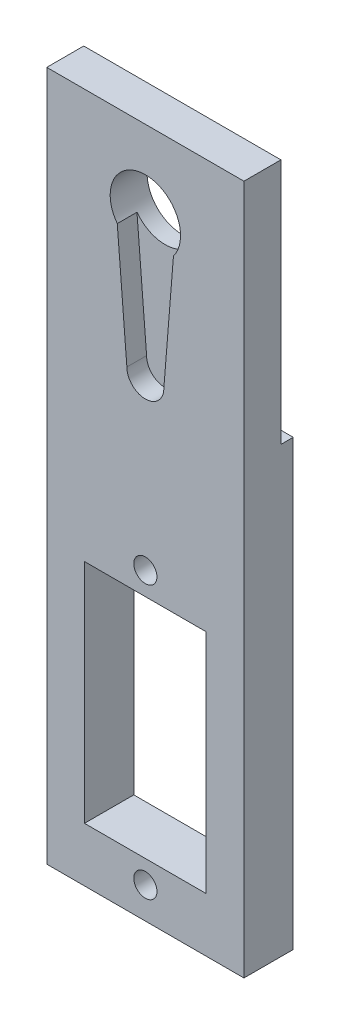
ISO-10303-21;
HEADER;
FILE_DESCRIPTION(('STEP AP214'),'2;1');
FILE_NAME('part.step','',(''),(''),'','','');
FILE_SCHEMA(('AUTOMOTIVE_DESIGN { 1 0 10303 214 1 1 1 1 }'));
ENDSEC;
DATA;
#1=APPLICATION_CONTEXT('core data for automotive mechanical design processes');
#2=APPLICATION_PROTOCOL_DEFINITION('international standard','automotive_design',2000,#1);
#3=PRODUCT_CONTEXT('',#1,'mechanical');
#4=PRODUCT('Part','Part','',(#3));
#5=PRODUCT_RELATED_PRODUCT_CATEGORY('part','',(#4));
#6=PRODUCT_DEFINITION_FORMATION('','',#4);
#7=PRODUCT_DEFINITION_CONTEXT('part definition',#1,'design');
#8=PRODUCT_DEFINITION('design','',#6,#7);
#9=PRODUCT_DEFINITION_SHAPE('','',#8);
#10=(LENGTH_UNIT() NAMED_UNIT(*) SI_UNIT(.MILLI.,.METRE.));
#11=(NAMED_UNIT(*) PLANE_ANGLE_UNIT() SI_UNIT($,.RADIAN.));
#12=(NAMED_UNIT(*) SI_UNIT($,.STERADIAN.) SOLID_ANGLE_UNIT());
#13=UNCERTAINTY_MEASURE_WITH_UNIT(LENGTH_MEASURE(1.E-05),#10,'distance_accuracy_value','');
#14=(GEOMETRIC_REPRESENTATION_CONTEXT(3) GLOBAL_UNCERTAINTY_ASSIGNED_CONTEXT((#13)) GLOBAL_UNIT_ASSIGNED_CONTEXT((#10,
#11,#12)) REPRESENTATION_CONTEXT('',''));
#15=CARTESIAN_POINT('',(0.,0.,0.));
#16=DIRECTION('',(0.,0.,1.));
#17=DIRECTION('',(1.,0.,0.));
#18=AXIS2_PLACEMENT_3D('',#15,#16,#17);
#19=CARTESIAN_POINT('',(9.99999999999999,35.,5.));
#20=DIRECTION('',(-1.,0.,0.));
#21=DIRECTION('',(0.,-1.,0.));
#22=AXIS2_PLACEMENT_3D('',#19,#20,#21);
#23=PLANE('',#22);
#24=DIRECTION('',(0.,1.,0.));
#25=VECTOR('',#24,1.);
#26=CARTESIAN_POINT('',(9.99999999999999,35.,0.));
#27=LINE('',#26,#25);
#28=CARTESIAN_POINT('',(10.,-35.,0.));
#29=VERTEX_POINT('',#28);
#30=CARTESIAN_POINT('',(10.,10.,0.));
#31=VERTEX_POINT('',#30);
#32=EDGE_CURVE('E189',#29,#31,#27,.T.);
#33=ORIENTED_EDGE('',*,*,#32,.T.);
#34=DIRECTION('',(0.,0.,-1.));
#35=VECTOR('',#34,1.);
#36=CARTESIAN_POINT('',(10.,10.,0.));
#37=LINE('',#36,#35);
#38=CARTESIAN_POINT('',(10.,10.,1.25));
#39=VERTEX_POINT('',#38);
#40=EDGE_CURVE('E62',#39,#31,#37,.T.);
#41=ORIENTED_EDGE('',*,*,#40,.F.);
#42=DIRECTION('',(0.,-1.,0.));
#43=VECTOR('',#42,1.);
#44=CARTESIAN_POINT('',(9.99999999999999,35.,1.25));
#45=LINE('',#44,#43);
#46=CARTESIAN_POINT('',(9.99999999999999,35.,1.25));
#47=VERTEX_POINT('',#46);
#48=EDGE_CURVE('E152',#47,#39,#45,.T.);
#49=ORIENTED_EDGE('',*,*,#48,.F.);
#50=DIRECTION('',(0.,0.,-1.));
#51=VECTOR('',#50,1.);
#52=CARTESIAN_POINT('',(9.99999999999999,35.,5.));
#53=LINE('',#52,#51);
#54=CARTESIAN_POINT('',(9.99999999999999,35.,5.));
#55=VERTEX_POINT('',#54);
#56=EDGE_CURVE('E12',#55,#47,#53,.T.);
#57=ORIENTED_EDGE('',*,*,#56,.F.);
#58=DIRECTION('',(0.,1.,0.));
#59=VECTOR('',#58,1.);
#60=CARTESIAN_POINT('',(9.99999999999999,35.,5.));
#61=LINE('',#60,#59);
#62=CARTESIAN_POINT('',(10.,-35.,5.));
#63=VERTEX_POINT('',#62);
#64=EDGE_CURVE('E171',#63,#55,#61,.T.);
#65=ORIENTED_EDGE('',*,*,#64,.F.);
#66=DIRECTION('',(0.,0.,-1.));
#67=VECTOR('',#66,1.);
#68=CARTESIAN_POINT('',(10.,-35.,5.));
#69=LINE('',#68,#67);
#70=EDGE_CURVE('E188',#63,#29,#69,.T.);
#71=ORIENTED_EDGE('',*,*,#70,.T.);
#72=EDGE_LOOP('',(#33,#41,#49,#57,#65,#71));
#73=FACE_BOUND('',#72,.T.);
#74=ADVANCED_FACE('F47',(#73),#23,.F.);
#75=CARTESIAN_POINT('',(-10.,35.,5.));
#76=DIRECTION('',(0.,-1.,0.));
#77=DIRECTION('',(0.,0.,-1.));
#78=AXIS2_PLACEMENT_3D('',#75,#76,#77);
#79=PLANE('',#78);
#80=ORIENTED_EDGE('',*,*,#56,.T.);
#81=DIRECTION('',(1.,0.,0.));
#82=VECTOR('',#81,1.);
#83=CARTESIAN_POINT('',(-20.,35.,1.25));
#84=LINE('',#83,#82);
#85=CARTESIAN_POINT('',(-10.,35.,1.25));
#86=VERTEX_POINT('',#85);
#87=EDGE_CURVE('E148',#86,#47,#84,.T.);
#88=ORIENTED_EDGE('',*,*,#87,.F.);
#89=DIRECTION('',(0.,0.,-1.));
#90=VECTOR('',#89,1.);
#91=CARTESIAN_POINT('',(-10.,35.,5.));
#92=LINE('',#91,#90);
#93=CARTESIAN_POINT('',(-10.,35.,5.));
#94=VERTEX_POINT('',#93);
#95=EDGE_CURVE('E55',#94,#86,#92,.T.);
#96=ORIENTED_EDGE('',*,*,#95,.F.);
#97=DIRECTION('',(-1.,0.,0.));
#98=VECTOR('',#97,1.);
#99=CARTESIAN_POINT('',(-10.,35.,5.));
#100=LINE('',#99,#98);
#101=EDGE_CURVE('E166',#55,#94,#100,.T.);
#102=ORIENTED_EDGE('',*,*,#101,.F.);
#103=EDGE_LOOP('',(#80,#88,#96,#102));
#104=FACE_BOUND('',#103,.T.);
#105=ADVANCED_FACE('F165',(#104),#79,.F.);
#106=CARTESIAN_POINT('',(-10.,35.,5.));
#107=DIRECTION('',(1.,0.,0.));
#108=DIRECTION('',(0.,1.,0.));
#109=AXIS2_PLACEMENT_3D('',#106,#107,#108);
#110=PLANE('',#109);
#111=DIRECTION('',(0.,-1.,0.));
#112=VECTOR('',#111,1.);
#113=CARTESIAN_POINT('',(-10.,35.,1.25));
#114=LINE('',#113,#112);
#115=CARTESIAN_POINT('',(-10.,10.,1.25));
#116=VERTEX_POINT('',#115);
#117=EDGE_CURVE('E154',#86,#116,#114,.T.);
#118=ORIENTED_EDGE('',*,*,#117,.T.);
#119=DIRECTION('',(0.,0.,-1.));
#120=VECTOR('',#119,1.);
#121=CARTESIAN_POINT('',(-10.,10.,5.));
#122=LINE('',#121,#120);
#123=CARTESIAN_POINT('',(-10.,10.,0.));
#124=VERTEX_POINT('',#123);
#125=EDGE_CURVE('E215',#116,#124,#122,.T.);
#126=ORIENTED_EDGE('',*,*,#125,.T.);
#127=DIRECTION('',(0.,-1.,0.));
#128=VECTOR('',#127,1.);
#129=CARTESIAN_POINT('',(-10.,35.,0.));
#130=LINE('',#129,#128);
#131=CARTESIAN_POINT('',(-10.,-35.,0.));
#132=VERTEX_POINT('',#131);
#133=EDGE_CURVE('E180',#124,#132,#130,.T.);
#134=ORIENTED_EDGE('',*,*,#133,.T.);
#135=DIRECTION('',(0.,0.,-1.));
#136=VECTOR('',#135,1.);
#137=CARTESIAN_POINT('',(-10.,-35.,5.));
#138=LINE('',#137,#136);
#139=CARTESIAN_POINT('',(-10.,-35.,5.));
#140=VERTEX_POINT('',#139);
#141=EDGE_CURVE('E194',#140,#132,#138,.T.);
#142=ORIENTED_EDGE('',*,*,#141,.F.);
#143=DIRECTION('',(0.,-1.,0.));
#144=VECTOR('',#143,1.);
#145=CARTESIAN_POINT('',(-10.,35.,5.));
#146=LINE('',#145,#144);
#147=EDGE_CURVE('E170',#94,#140,#146,.T.);
#148=ORIENTED_EDGE('',*,*,#147,.F.);
#149=ORIENTED_EDGE('',*,*,#95,.T.);
#150=EDGE_LOOP('',(#118,#126,#134,#142,#148,#149));
#151=FACE_BOUND('',#150,.T.);
#152=ADVANCED_FACE('F198',(#151),#110,.F.);
#153=CARTESIAN_POINT('',(-10.,-35.,5.));
#154=DIRECTION('',(0.,1.,0.));
#155=DIRECTION('',(0.,0.,1.));
#156=AXIS2_PLACEMENT_3D('',#153,#154,#155);
#157=PLANE('',#156);
#158=DIRECTION('',(1.,0.,0.));
#159=VECTOR('',#158,1.);
#160=CARTESIAN_POINT('',(-10.,-35.,0.));
#161=LINE('',#160,#159);
#162=EDGE_CURVE('E178',#132,#29,#161,.T.);
#163=ORIENTED_EDGE('',*,*,#162,.T.);
#164=ORIENTED_EDGE('',*,*,#70,.F.);
#165=DIRECTION('',(1.,0.,0.));
#166=VECTOR('',#165,1.);
#167=CARTESIAN_POINT('',(-10.,-35.,5.));
#168=LINE('',#167,#166);
#169=EDGE_CURVE('E175',#140,#63,#168,.T.);
#170=ORIENTED_EDGE('',*,*,#169,.F.);
#171=ORIENTED_EDGE('',*,*,#141,.T.);
#172=EDGE_LOOP('',(#163,#164,#170,#171));
#173=FACE_BOUND('',#172,.T.);
#174=ADVANCED_FACE('F204',(#173),#157,.F.);
#175=CARTESIAN_POINT('',(0.,0.,5.));
#176=DIRECTION('',(0.,0.,1.));
#177=DIRECTION('',(1.,0.,0.));
#178=AXIS2_PLACEMENT_3D('',#175,#176,#177);
#179=PLANE('',#178);
#180=CARTESIAN_POINT('',(0.,-31.82,5.));
#181=DIRECTION('',(0.,0.,1.));
#182=DIRECTION('',(-1.,0.,0.));
#183=AXIS2_PLACEMENT_3D('',#180,#181,#182);
#184=CIRCLE('',#183,1.175);
#185=CARTESIAN_POINT('',(-1.175,-31.82,5.));
#186=VERTEX_POINT('',#185);
#187=EDGE_CURVE('E217',#186,#186,#184,.T.);
#188=ORIENTED_EDGE('',*,*,#187,.F.);
#189=EDGE_LOOP('',(#188));
#190=FACE_BOUND('',#189,.T.);
#191=CARTESIAN_POINT('',(0.,-4.17999999999999,5.));
#192=DIRECTION('',(0.,0.,1.));
#193=DIRECTION('',(1.,0.,0.));
#194=AXIS2_PLACEMENT_3D('',#191,#192,#193);
#195=CIRCLE('',#194,1.175);
#196=CARTESIAN_POINT('',(1.175,-4.17999999999999,5.));
#197=VERTEX_POINT('',#196);
#198=EDGE_CURVE('E221',#197,#197,#195,.T.);
#199=ORIENTED_EDGE('',*,*,#198,.F.);
#200=EDGE_LOOP('',(#199));
#201=FACE_BOUND('',#200,.T.);
#202=DIRECTION('',(0.,1.,0.));
#203=VECTOR('',#202,1.);
#204=CARTESIAN_POINT('',(6.175,-6.49999999999998,5.));
#205=LINE('',#204,#203);
#206=CARTESIAN_POINT('',(6.175,-29.5,5.));
#207=VERTEX_POINT('',#206);
#208=CARTESIAN_POINT('',(6.175,-6.49999999999998,5.));
#209=VERTEX_POINT('',#208);
#210=EDGE_CURVE('E70',#207,#209,#205,.T.);
#211=ORIENTED_EDGE('',*,*,#210,.F.);
#212=DIRECTION('',(1.,0.,0.));
#213=VECTOR('',#212,1.);
#214=CARTESIAN_POINT('',(-6.175,-29.5,5.));
#215=LINE('',#214,#213);
#216=CARTESIAN_POINT('',(-6.175,-29.5,5.));
#217=VERTEX_POINT('',#216);
#218=EDGE_CURVE('E233',#217,#207,#215,.T.);
#219=ORIENTED_EDGE('',*,*,#218,.F.);
#220=DIRECTION('',(0.,-1.,0.));
#221=VECTOR('',#220,1.);
#222=CARTESIAN_POINT('',(-6.175,-6.49999999999998,5.));
#223=LINE('',#222,#221);
#224=CARTESIAN_POINT('',(-6.175,-6.49999999999998,5.));
#225=VERTEX_POINT('',#224);
#226=EDGE_CURVE('E247',#225,#217,#223,.T.);
#227=ORIENTED_EDGE('',*,*,#226,.F.);
#228=DIRECTION('',(-1.,0.,0.));
#229=VECTOR('',#228,1.);
#230=CARTESIAN_POINT('',(-6.175,-6.49999999999998,5.));
#231=LINE('',#230,#229);
#232=EDGE_CURVE('E244',#209,#225,#231,.T.);
#233=ORIENTED_EDGE('',*,*,#232,.F.);
#234=EDGE_LOOP('',(#211,#219,#227,#233));
#235=FACE_BOUND('',#234,.T.);
#236=CARTESIAN_POINT('',(0.,12.7392068094734,5.));
#237=DIRECTION('',(0.,0.,1.));
#238=DIRECTION('',(1.,0.,0.));
#239=AXIS2_PLACEMENT_3D('',#236,#237,#238);
#240=CIRCLE('',#239,1.875);
#241=CARTESIAN_POINT('',(-1.875,12.7392068094734,5.));
#242=VERTEX_POINT('',#241);
#243=CARTESIAN_POINT('',(1.875,12.7392068094734,5.));
#244=VERTEX_POINT('',#243);
#245=EDGE_CURVE('E271',#242,#244,#240,.T.);
#246=ORIENTED_EDGE('',*,*,#245,.F.);
#247=DIRECTION('',(0.0802469135802469,-0.996775016170071,0.));
#248=VECTOR('',#247,1.);
#249=CARTESIAN_POINT('',(-0.843940626703052,-0.0679427447912119,5.));
#250=LINE('',#249,#248);
#251=CARTESIAN_POINT('',(-2.85,24.8500232559397,5.));
#252=VERTEX_POINT('',#251);
#253=EDGE_CURVE('E265',#252,#242,#250,.T.);
#254=ORIENTED_EDGE('',*,*,#253,.F.);
#255=CARTESIAN_POINT('',(0.,27.,5.));
#256=DIRECTION('',(0.,0.,1.));
#257=DIRECTION('',(1.,0.,0.));
#258=AXIS2_PLACEMENT_3D('',#255,#256,#257);
#259=CIRCLE('',#258,3.57);
#260=CARTESIAN_POINT('',(2.85,24.8500232559397,5.));
#261=VERTEX_POINT('',#260);
#262=EDGE_CURVE('E183',#261,#252,#259,.T.);
#263=ORIENTED_EDGE('',*,*,#262,.F.);
#264=DIRECTION('',(-0.0802469135802469,-0.996775016170071,0.));
#265=VECTOR('',#264,1.);
#266=CARTESIAN_POINT('',(0.843940626703052,-0.0679427447912119,5.));
#267=LINE('',#266,#265);
#268=EDGE_CURVE('E274',#261,#244,#267,.T.);
#269=ORIENTED_EDGE('',*,*,#268,.T.);
#270=EDGE_LOOP('',(#246,#254,#263,#269));
#271=FACE_BOUND('',#270,.T.);
#272=ORIENTED_EDGE('',*,*,#64,.T.);
#273=ORIENTED_EDGE('',*,*,#101,.T.);
#274=ORIENTED_EDGE('',*,*,#147,.T.);
#275=ORIENTED_EDGE('',*,*,#169,.T.);
#276=EDGE_LOOP('',(#272,#273,#274,#275));
#277=FACE_BOUND('',#276,.T.);
#278=ADVANCED_FACE('F173',(#190,#201,#235,#271,#277),#179,.T.);
#279=CARTESIAN_POINT('',(0.,0.,0.));
#280=DIRECTION('',(0.,0.,1.));
#281=DIRECTION('',(1.,0.,0.));
#282=AXIS2_PLACEMENT_3D('',#279,#280,#281);
#283=PLANE('',#282);
#284=CARTESIAN_POINT('',(0.,-31.82,0.));
#285=DIRECTION('',(0.,0.,1.));
#286=DIRECTION('',(-1.,0.,0.));
#287=AXIS2_PLACEMENT_3D('',#284,#285,#286);
#288=CIRCLE('',#287,1.175);
#289=CARTESIAN_POINT('',(-1.175,-31.82,0.));
#290=VERTEX_POINT('',#289);
#291=EDGE_CURVE('E224',#290,#290,#288,.T.);
#292=ORIENTED_EDGE('',*,*,#291,.T.);
#293=EDGE_LOOP('',(#292));
#294=FACE_BOUND('',#293,.T.);
#295=CARTESIAN_POINT('',(0.,-4.17999999999999,0.));
#296=DIRECTION('',(0.,0.,1.));
#297=DIRECTION('',(1.,0.,0.));
#298=AXIS2_PLACEMENT_3D('',#295,#296,#297);
#299=CIRCLE('',#298,1.175);
#300=CARTESIAN_POINT('',(1.175,-4.17999999999999,0.));
#301=VERTEX_POINT('',#300);
#302=EDGE_CURVE('E218',#301,#301,#299,.T.);
#303=ORIENTED_EDGE('',*,*,#302,.T.);
#304=EDGE_LOOP('',(#303));
#305=FACE_BOUND('',#304,.T.);
#306=DIRECTION('',(1.,0.,0.));
#307=VECTOR('',#306,1.);
#308=CARTESIAN_POINT('',(-6.175,-29.5,0.));
#309=LINE('',#308,#307);
#310=CARTESIAN_POINT('',(-6.175,-29.5,0.));
#311=VERTEX_POINT('',#310);
#312=CARTESIAN_POINT('',(6.175,-29.5,0.));
#313=VERTEX_POINT('',#312);
#314=EDGE_CURVE('E239',#311,#313,#309,.T.);
#315=ORIENTED_EDGE('',*,*,#314,.T.);
#316=DIRECTION('',(0.,1.,0.));
#317=VECTOR('',#316,1.);
#318=CARTESIAN_POINT('',(6.175,-6.49999999999998,0.));
#319=LINE('',#318,#317);
#320=CARTESIAN_POINT('',(6.175,-6.49999999999998,0.));
#321=VERTEX_POINT('',#320);
#322=EDGE_CURVE('E229',#313,#321,#319,.T.);
#323=ORIENTED_EDGE('',*,*,#322,.T.);
#324=DIRECTION('',(-1.,0.,0.));
#325=VECTOR('',#324,1.);
#326=CARTESIAN_POINT('',(-6.175,-6.49999999999998,0.));
#327=LINE('',#326,#325);
#328=CARTESIAN_POINT('',(-6.175,-6.49999999999998,0.));
#329=VERTEX_POINT('',#328);
#330=EDGE_CURVE('E232',#321,#329,#327,.T.);
#331=ORIENTED_EDGE('',*,*,#330,.T.);
#332=DIRECTION('',(0.,-1.,0.));
#333=VECTOR('',#332,1.);
#334=CARTESIAN_POINT('',(-6.175,-6.49999999999998,0.));
#335=LINE('',#334,#333);
#336=EDGE_CURVE('E236',#329,#311,#335,.T.);
#337=ORIENTED_EDGE('',*,*,#336,.T.);
#338=EDGE_LOOP('',(#315,#323,#331,#337));
#339=FACE_BOUND('',#338,.T.);
#340=ORIENTED_EDGE('',*,*,#133,.F.);
#341=DIRECTION('',(1.,0.,0.));
#342=VECTOR('',#341,1.);
#343=CARTESIAN_POINT('',(-20.,10.,0.));
#344=LINE('',#343,#342);
#345=EDGE_CURVE('E208',#124,#31,#344,.T.);
#346=ORIENTED_EDGE('',*,*,#345,.T.);
#347=ORIENTED_EDGE('',*,*,#32,.F.);
#348=ORIENTED_EDGE('',*,*,#162,.F.);
#349=EDGE_LOOP('',(#340,#346,#347,#348));
#350=FACE_BOUND('',#349,.T.);
#351=ADVANCED_FACE('F207',(#294,#305,#339,#350),#283,.F.);
#352=CARTESIAN_POINT('',(0.,12.7392068094734,3.));
#353=DIRECTION('',(0.,0.,1.));
#354=DIRECTION('',(1.,0.,0.));
#355=AXIS2_PLACEMENT_3D('',#352,#353,#354);
#356=CYLINDRICAL_SURFACE('',#355,1.875);
#357=ORIENTED_EDGE('',*,*,#245,.T.);
#358=DIRECTION('',(0.,0.,1.));
#359=VECTOR('',#358,1.);
#360=CARTESIAN_POINT('',(1.875,12.7392068094734,3.));
#361=LINE('',#360,#359);
#362=CARTESIAN_POINT('',(1.875,12.7392068094734,3.));
#363=VERTEX_POINT('',#362);
#364=EDGE_CURVE('E270',#363,#244,#361,.T.);
#365=ORIENTED_EDGE('',*,*,#364,.F.);
#366=CARTESIAN_POINT('',(0.,12.7392068094734,3.));
#367=DIRECTION('',(0.,0.,1.));
#368=DIRECTION('',(1.,0.,0.));
#369=AXIS2_PLACEMENT_3D('',#366,#367,#368);
#370=CIRCLE('',#369,1.875);
#371=CARTESIAN_POINT('',(-1.875,12.7392068094734,3.));
#372=VERTEX_POINT('',#371);
#373=EDGE_CURVE('E261',#372,#363,#370,.T.);
#374=ORIENTED_EDGE('',*,*,#373,.F.);
#375=DIRECTION('',(0.,0.,1.));
#376=VECTOR('',#375,1.);
#377=CARTESIAN_POINT('',(-1.875,12.7392068094734,3.));
#378=LINE('',#377,#376);
#379=EDGE_CURVE('E191',#372,#242,#378,.T.);
#380=ORIENTED_EDGE('',*,*,#379,.T.);
#381=EDGE_LOOP('',(#357,#365,#374,#380));
#382=FACE_BOUND('',#381,.T.);
#383=ADVANCED_FACE('F292',(#382),#356,.F.);
#384=CARTESIAN_POINT('',(-0.843940626703052,-0.0679427447912119,3.));
#385=DIRECTION('',(-0.996775016170071,-0.0802469135802469,0.));
#386=DIRECTION('',(0.0802469135802469,-0.996775016170071,0.));
#387=AXIS2_PLACEMENT_3D('',#384,#385,#386);
#388=PLANE('',#387);
#389=ORIENTED_EDGE('',*,*,#253,.T.);
#390=ORIENTED_EDGE('',*,*,#379,.F.);
#391=DIRECTION('',(0.0802469135802469,-0.996775016170071,0.));
#392=VECTOR('',#391,1.);
#393=CARTESIAN_POINT('',(-0.843940626703052,-0.0679427447912119,3.));
#394=LINE('',#393,#392);
#395=CARTESIAN_POINT('',(-2.85,24.8500232559397,3.));
#396=VERTEX_POINT('',#395);
#397=EDGE_CURVE('E267',#396,#372,#394,.T.);
#398=ORIENTED_EDGE('',*,*,#397,.F.);
#399=DIRECTION('',(0.,0.,1.));
#400=VECTOR('',#399,1.);
#401=CARTESIAN_POINT('',(-2.85,24.8500232559397,3.));
#402=LINE('',#401,#400);
#403=EDGE_CURVE('E280',#396,#252,#402,.T.);
#404=ORIENTED_EDGE('',*,*,#403,.T.);
#405=EDGE_LOOP('',(#389,#390,#398,#404));
#406=FACE_BOUND('',#405,.T.);
#407=ADVANCED_FACE('F304',(#406),#388,.F.);
#408=CARTESIAN_POINT('',(0.843940626703052,-0.0679427447912119,3.));
#409=DIRECTION('',(-0.996775016170071,0.0802469135802469,0.));
#410=DIRECTION('',(-0.0802469135802469,-0.996775016170071,0.));
#411=AXIS2_PLACEMENT_3D('',#408,#409,#410);
#412=PLANE('',#411);
#413=ORIENTED_EDGE('',*,*,#268,.F.);
#414=DIRECTION('',(0.,0.,1.));
#415=VECTOR('',#414,1.);
#416=CARTESIAN_POINT('',(2.85,24.8500232559397,3.));
#417=LINE('',#416,#415);
#418=CARTESIAN_POINT('',(2.85,24.8500232559397,3.));
#419=VERTEX_POINT('',#418);
#420=EDGE_CURVE('E282',#419,#261,#417,.T.);
#421=ORIENTED_EDGE('',*,*,#420,.F.);
#422=DIRECTION('',(-0.0802469135802469,-0.996775016170071,0.));
#423=VECTOR('',#422,1.);
#424=CARTESIAN_POINT('',(0.843940626703052,-0.0679427447912119,3.));
#425=LINE('',#424,#423);
#426=EDGE_CURVE('E264',#419,#363,#425,.T.);
#427=ORIENTED_EDGE('',*,*,#426,.T.);
#428=ORIENTED_EDGE('',*,*,#364,.T.);
#429=EDGE_LOOP('',(#413,#421,#427,#428));
#430=FACE_BOUND('',#429,.T.);
#431=ADVANCED_FACE('F286',(#430),#412,.T.);
#432=CARTESIAN_POINT('',(0.,0.,3.));
#433=DIRECTION('',(0.,0.,1.));
#434=DIRECTION('',(1.,0.,0.));
#435=AXIS2_PLACEMENT_3D('',#432,#433,#434);
#436=PLANE('',#435);
#437=CARTESIAN_POINT('',(0.,27.,3.));
#438=DIRECTION('',(0.,0.,1.));
#439=DIRECTION('',(1.,0.,0.));
#440=AXIS2_PLACEMENT_3D('',#437,#438,#439);
#441=CIRCLE('',#440,3.57);
#442=EDGE_CURVE('E254',#396,#419,#441,.T.);
#443=ORIENTED_EDGE('',*,*,#442,.F.);
#444=ORIENTED_EDGE('',*,*,#397,.T.);
#445=ORIENTED_EDGE('',*,*,#373,.T.);
#446=ORIENTED_EDGE('',*,*,#426,.F.);
#447=EDGE_LOOP('',(#443,#444,#445,#446));
#448=FACE_BOUND('',#447,.T.);
#449=ADVANCED_FACE('F302',(#448),#436,.T.);
#450=CARTESIAN_POINT('',(0.,27.,3.));
#451=DIRECTION('',(0.,0.,1.));
#452=DIRECTION('',(1.,0.,0.));
#453=AXIS2_PLACEMENT_3D('',#450,#451,#452);
#454=CYLINDRICAL_SURFACE('',#453,3.57);
#455=CARTESIAN_POINT('',(0.,27.,1.25));
#456=DIRECTION('',(0.,0.,1.));
#457=DIRECTION('',(0.,-1.,0.));
#458=AXIS2_PLACEMENT_3D('',#455,#456,#457);
#459=CIRCLE('',#458,3.57);
#460=CARTESIAN_POINT('',(0.,23.43,1.25));
#461=VERTEX_POINT('',#460);
#462=EDGE_CURVE('E50',#461,#461,#459,.F.);
#463=ORIENTED_EDGE('',*,*,#462,.T.);
#464=EDGE_LOOP('',(#463));
#465=FACE_BOUND('',#464,.T.);
#466=ORIENTED_EDGE('',*,*,#403,.F.);
#467=ORIENTED_EDGE('',*,*,#442,.T.);
#468=ORIENTED_EDGE('',*,*,#420,.T.);
#469=ORIENTED_EDGE('',*,*,#262,.T.);
#470=EDGE_LOOP('',(#466,#467,#468,#469));
#471=FACE_BOUND('',#470,.T.);
#472=ADVANCED_FACE('F299',(#465,#471),#454,.F.);
#473=CARTESIAN_POINT('',(6.175,-6.49999999999998,0.));
#474=DIRECTION('',(1.,0.,0.));
#475=DIRECTION('',(0.,1.,0.));
#476=AXIS2_PLACEMENT_3D('',#473,#474,#475);
#477=PLANE('',#476);
#478=ORIENTED_EDGE('',*,*,#210,.T.);
#479=DIRECTION('',(0.,0.,1.));
#480=VECTOR('',#479,1.);
#481=CARTESIAN_POINT('',(6.175,-6.49999999999998,0.));
#482=LINE('',#481,#480);
#483=EDGE_CURVE('E242',#321,#209,#482,.T.);
#484=ORIENTED_EDGE('',*,*,#483,.F.);
#485=ORIENTED_EDGE('',*,*,#322,.F.);
#486=DIRECTION('',(0.,0.,1.));
#487=VECTOR('',#486,1.);
#488=CARTESIAN_POINT('',(6.175,-29.5,0.));
#489=LINE('',#488,#487);
#490=EDGE_CURVE('E252',#313,#207,#489,.T.);
#491=ORIENTED_EDGE('',*,*,#490,.T.);
#492=EDGE_LOOP('',(#478,#484,#485,#491));
#493=FACE_BOUND('',#492,.T.);
#494=ADVANCED_FACE('F332',(#493),#477,.F.);
#495=CARTESIAN_POINT('',(-6.175,-29.5,0.));
#496=DIRECTION('',(0.,-1.,0.));
#497=DIRECTION('',(0.,0.,-1.));
#498=AXIS2_PLACEMENT_3D('',#495,#496,#497);
#499=PLANE('',#498);
#500=ORIENTED_EDGE('',*,*,#218,.T.);
#501=ORIENTED_EDGE('',*,*,#490,.F.);
#502=ORIENTED_EDGE('',*,*,#314,.F.);
#503=DIRECTION('',(0.,0.,1.));
#504=VECTOR('',#503,1.);
#505=CARTESIAN_POINT('',(-6.175,-29.5,0.));
#506=LINE('',#505,#504);
#507=EDGE_CURVE('E255',#311,#217,#506,.T.);
#508=ORIENTED_EDGE('',*,*,#507,.T.);
#509=EDGE_LOOP('',(#500,#501,#502,#508));
#510=FACE_BOUND('',#509,.T.);
#511=ADVANCED_FACE('F338',(#510),#499,.F.);
#512=CARTESIAN_POINT('',(-6.175,-6.49999999999998,0.));
#513=DIRECTION('',(-1.,0.,0.));
#514=DIRECTION('',(0.,-1.,0.));
#515=AXIS2_PLACEMENT_3D('',#512,#513,#514);
#516=PLANE('',#515);
#517=ORIENTED_EDGE('',*,*,#226,.T.);
#518=ORIENTED_EDGE('',*,*,#507,.F.);
#519=ORIENTED_EDGE('',*,*,#336,.F.);
#520=DIRECTION('',(0.,0.,1.));
#521=VECTOR('',#520,1.);
#522=CARTESIAN_POINT('',(-6.175,-6.49999999999998,0.));
#523=LINE('',#522,#521);
#524=EDGE_CURVE('E257',#329,#225,#523,.T.);
#525=ORIENTED_EDGE('',*,*,#524,.T.);
#526=EDGE_LOOP('',(#517,#518,#519,#525));
#527=FACE_BOUND('',#526,.T.);
#528=ADVANCED_FACE('F361',(#527),#516,.F.);
#529=CARTESIAN_POINT('',(-6.175,-6.49999999999998,0.));
#530=DIRECTION('',(0.,1.,0.));
#531=DIRECTION('',(-1.,0.,0.));
#532=AXIS2_PLACEMENT_3D('',#529,#530,#531);
#533=PLANE('',#532);
#534=ORIENTED_EDGE('',*,*,#232,.T.);
#535=ORIENTED_EDGE('',*,*,#524,.F.);
#536=ORIENTED_EDGE('',*,*,#330,.F.);
#537=ORIENTED_EDGE('',*,*,#483,.T.);
#538=EDGE_LOOP('',(#534,#535,#536,#537));
#539=FACE_BOUND('',#538,.T.);
#540=ADVANCED_FACE('F354',(#539),#533,.F.);
#541=CARTESIAN_POINT('',(0.,-4.17999999999999,0.));
#542=DIRECTION('',(0.,0.,1.));
#543=DIRECTION('',(1.,0.,0.));
#544=AXIS2_PLACEMENT_3D('',#541,#542,#543);
#545=CYLINDRICAL_SURFACE('',#544,1.175);
#546=ORIENTED_EDGE('',*,*,#302,.F.);
#547=EDGE_LOOP('',(#546));
#548=FACE_BOUND('',#547,.T.);
#549=ORIENTED_EDGE('',*,*,#198,.T.);
#550=EDGE_LOOP('',(#549));
#551=FACE_BOUND('',#550,.T.);
#552=ADVANCED_FACE('F351',(#548,#551),#545,.F.);
#553=CARTESIAN_POINT('',(0.,-31.82,0.));
#554=DIRECTION('',(0.,0.,1.));
#555=DIRECTION('',(1.,0.,0.));
#556=AXIS2_PLACEMENT_3D('',#553,#554,#555);
#557=CYLINDRICAL_SURFACE('',#556,1.175);
#558=ORIENTED_EDGE('',*,*,#291,.F.);
#559=EDGE_LOOP('',(#558));
#560=FACE_BOUND('',#559,.T.);
#561=ORIENTED_EDGE('',*,*,#187,.T.);
#562=EDGE_LOOP('',(#561));
#563=FACE_BOUND('',#562,.T.);
#564=ADVANCED_FACE('F348',(#560,#563),#557,.F.);
#565=CARTESIAN_POINT('',(-20.,10.,0.));
#566=DIRECTION('',(0.,-1.,0.));
#567=DIRECTION('',(1.,0.,0.));
#568=AXIS2_PLACEMENT_3D('',#565,#566,#567);
#569=PLANE('',#568);
#570=DIRECTION('',(1.,0.,0.));
#571=VECTOR('',#570,1.);
#572=CARTESIAN_POINT('',(-20.,10.,1.25));
#573=LINE('',#572,#571);
#574=EDGE_CURVE('E158',#116,#39,#573,.T.);
#575=ORIENTED_EDGE('',*,*,#574,.T.);
#576=ORIENTED_EDGE('',*,*,#40,.T.);
#577=ORIENTED_EDGE('',*,*,#345,.F.);
#578=ORIENTED_EDGE('',*,*,#125,.F.);
#579=EDGE_LOOP('',(#575,#576,#577,#578));
#580=FACE_BOUND('',#579,.T.);
#581=ADVANCED_FACE('F343',(#580),#569,.F.);
#582=CARTESIAN_POINT('',(-20.,35.,1.25));
#583=DIRECTION('',(0.,0.,1.));
#584=DIRECTION('',(0.,-1.,0.));
#585=AXIS2_PLACEMENT_3D('',#582,#583,#584);
#586=PLANE('',#585);
#587=ORIENTED_EDGE('',*,*,#462,.F.);
#588=EDGE_LOOP('',(#587));
#589=FACE_BOUND('',#588,.T.);
#590=ORIENTED_EDGE('',*,*,#87,.T.);
#591=ORIENTED_EDGE('',*,*,#48,.T.);
#592=ORIENTED_EDGE('',*,*,#574,.F.);
#593=ORIENTED_EDGE('',*,*,#117,.F.);
#594=EDGE_LOOP('',(#590,#591,#592,#593));
#595=FACE_BOUND('',#594,.T.);
#596=ADVANCED_FACE('F150',(#589,#595),#586,.F.);
#597=CLOSED_SHELL('',(#74,#105,#152,#174,#278,#351,#383,#407,#431,#449,#472,#494,#511,#528,#540,
#552,#564,#581,#596));
#598=MANIFOLD_SOLID_BREP('B2',#597);
#599=ADVANCED_BREP_SHAPE_REPRESENTATION('',(#18,#598),#14);
#600=SHAPE_DEFINITION_REPRESENTATION(#9,#599);
ENDSEC;
END-ISO-10303-21;
